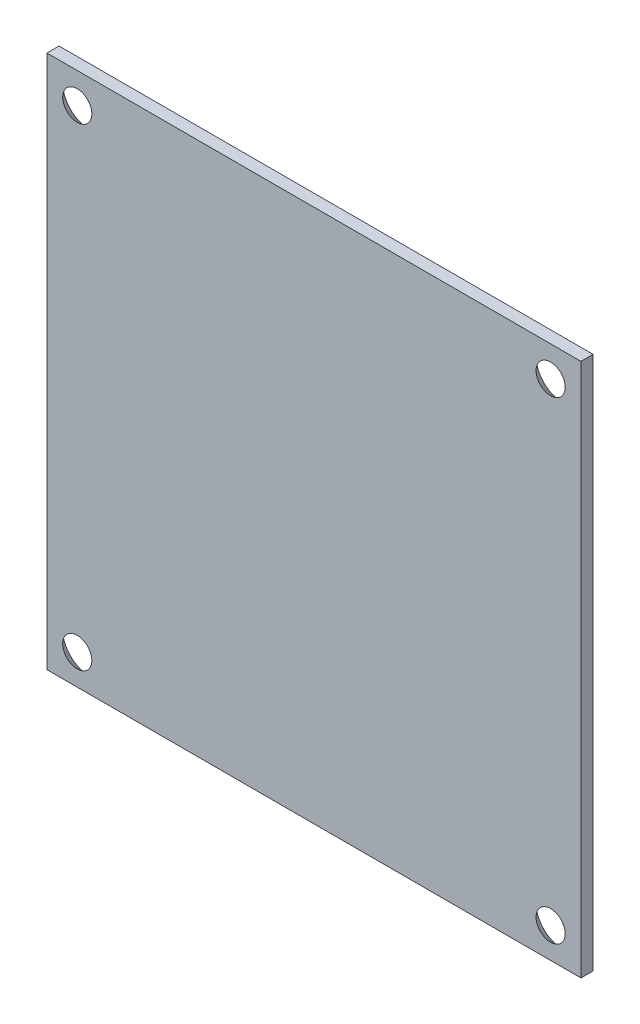
ISO-10303-21;
HEADER;
FILE_DESCRIPTION(('STEP AP214'),'2;1');
FILE_NAME('part.step','',(''),(''),'','','');
FILE_SCHEMA(('AUTOMOTIVE_DESIGN { 1 0 10303 214 1 1 1 1 }'));
ENDSEC;
DATA;
#1=APPLICATION_CONTEXT('core data for automotive mechanical design processes');
#2=APPLICATION_PROTOCOL_DEFINITION('international standard','automotive_design',2000,#1);
#3=PRODUCT_CONTEXT('',#1,'mechanical');
#4=PRODUCT('Part','Part','',(#3));
#5=PRODUCT_RELATED_PRODUCT_CATEGORY('part','',(#4));
#6=PRODUCT_DEFINITION_FORMATION('','',#4);
#7=PRODUCT_DEFINITION_CONTEXT('part definition',#1,'design');
#8=PRODUCT_DEFINITION('design','',#6,#7);
#9=PRODUCT_DEFINITION_SHAPE('','',#8);
#10=(LENGTH_UNIT() NAMED_UNIT(*) SI_UNIT(.MILLI.,.METRE.));
#11=(NAMED_UNIT(*) PLANE_ANGLE_UNIT() SI_UNIT($,.RADIAN.));
#12=(NAMED_UNIT(*) SI_UNIT($,.STERADIAN.) SOLID_ANGLE_UNIT());
#13=UNCERTAINTY_MEASURE_WITH_UNIT(LENGTH_MEASURE(1.E-05),#10,'distance_accuracy_value','');
#14=(GEOMETRIC_REPRESENTATION_CONTEXT(3) GLOBAL_UNCERTAINTY_ASSIGNED_CONTEXT((#13)) GLOBAL_UNIT_ASSIGNED_CONTEXT((#10,
#11,#12)) REPRESENTATION_CONTEXT('',''));
#15=CARTESIAN_POINT('',(0.,0.,0.));
#16=DIRECTION('',(0.,0.,1.));
#17=DIRECTION('',(1.,0.,0.));
#18=AXIS2_PLACEMENT_3D('',#15,#16,#17);
#19=CARTESIAN_POINT('',(22.,22.,1.));
#20=DIRECTION('',(0.,-1.,0.));
#21=DIRECTION('',(0.,0.,-1.));
#22=AXIS2_PLACEMENT_3D('',#19,#20,#21);
#23=PLANE('',#22);
#24=DIRECTION('',(-1.,0.,0.));
#25=VECTOR('',#24,1.);
#26=CARTESIAN_POINT('',(22.,22.,0.));
#27=LINE('',#26,#25);
#28=CARTESIAN_POINT('',(22.,22.,0.));
#29=VERTEX_POINT('',#28);
#30=CARTESIAN_POINT('',(-22.,22.,0.));
#31=VERTEX_POINT('',#30);
#32=EDGE_CURVE('E113',#29,#31,#27,.T.);
#33=ORIENTED_EDGE('',*,*,#32,.T.);
#34=DIRECTION('',(0.,0.,-1.));
#35=VECTOR('',#34,1.);
#36=CARTESIAN_POINT('',(-22.,22.,1.));
#37=LINE('',#36,#35);
#38=CARTESIAN_POINT('',(-22.,22.,1.));
#39=VERTEX_POINT('',#38);
#40=EDGE_CURVE('E11',#39,#31,#37,.T.);
#41=ORIENTED_EDGE('',*,*,#40,.F.);
#42=DIRECTION('',(-1.,0.,0.));
#43=VECTOR('',#42,1.);
#44=CARTESIAN_POINT('',(22.,22.,1.));
#45=LINE('',#44,#43);
#46=CARTESIAN_POINT('',(22.,22.,1.));
#47=VERTEX_POINT('',#46);
#48=EDGE_CURVE('E97',#47,#39,#45,.T.);
#49=ORIENTED_EDGE('',*,*,#48,.F.);
#50=DIRECTION('',(0.,0.,-1.));
#51=VECTOR('',#50,1.);
#52=CARTESIAN_POINT('',(22.,22.,1.));
#53=LINE('',#52,#51);
#54=EDGE_CURVE('E109',#47,#29,#53,.T.);
#55=ORIENTED_EDGE('',*,*,#54,.T.);
#56=EDGE_LOOP('',(#33,#41,#49,#55));
#57=FACE_BOUND('',#56,.T.);
#58=ADVANCED_FACE('F45',(#57),#23,.F.);
#59=CARTESIAN_POINT('',(-22.,-22.,1.));
#60=DIRECTION('',(1.,0.,0.));
#61=DIRECTION('',(0.,0.,-1.));
#62=AXIS2_PLACEMENT_3D('',#59,#60,#61);
#63=PLANE('',#62);
#64=DIRECTION('',(0.,-1.,0.));
#65=VECTOR('',#64,1.);
#66=CARTESIAN_POINT('',(-22.,-22.,0.));
#67=LINE('',#66,#65);
#68=CARTESIAN_POINT('',(-22.,-22.,0.));
#69=VERTEX_POINT('',#68);
#70=EDGE_CURVE('E102',#31,#69,#67,.T.);
#71=ORIENTED_EDGE('',*,*,#70,.T.);
#72=DIRECTION('',(0.,0.,-1.));
#73=VECTOR('',#72,1.);
#74=CARTESIAN_POINT('',(-22.,-22.,1.));
#75=LINE('',#74,#73);
#76=CARTESIAN_POINT('',(-22.,-22.,1.));
#77=VERTEX_POINT('',#76);
#78=EDGE_CURVE('E54',#77,#69,#75,.T.);
#79=ORIENTED_EDGE('',*,*,#78,.F.);
#80=DIRECTION('',(0.,-1.,0.));
#81=VECTOR('',#80,1.);
#82=CARTESIAN_POINT('',(-22.,-22.,1.));
#83=LINE('',#82,#81);
#84=EDGE_CURVE('E92',#39,#77,#83,.T.);
#85=ORIENTED_EDGE('',*,*,#84,.F.);
#86=ORIENTED_EDGE('',*,*,#40,.T.);
#87=EDGE_LOOP('',(#71,#79,#85,#86));
#88=FACE_BOUND('',#87,.T.);
#89=ADVANCED_FACE('F101',(#88),#63,.F.);
#90=CARTESIAN_POINT('',(22.,-22.,1.));
#91=DIRECTION('',(0.,1.,0.));
#92=DIRECTION('',(0.,0.,1.));
#93=AXIS2_PLACEMENT_3D('',#90,#91,#92);
#94=PLANE('',#93);
#95=DIRECTION('',(1.,0.,0.));
#96=VECTOR('',#95,1.);
#97=CARTESIAN_POINT('',(22.,-22.,0.));
#98=LINE('',#97,#96);
#99=CARTESIAN_POINT('',(22.,-22.,0.));
#100=VERTEX_POINT('',#99);
#101=EDGE_CURVE('E79',#69,#100,#98,.T.);
#102=ORIENTED_EDGE('',*,*,#101,.T.);
#103=DIRECTION('',(0.,0.,-1.));
#104=VECTOR('',#103,1.);
#105=CARTESIAN_POINT('',(22.,-22.,1.));
#106=LINE('',#105,#104);
#107=CARTESIAN_POINT('',(22.,-22.,1.));
#108=VERTEX_POINT('',#107);
#109=EDGE_CURVE('E104',#108,#100,#106,.T.);
#110=ORIENTED_EDGE('',*,*,#109,.F.);
#111=DIRECTION('',(1.,0.,0.));
#112=VECTOR('',#111,1.);
#113=CARTESIAN_POINT('',(22.,-22.,1.));
#114=LINE('',#113,#112);
#115=EDGE_CURVE('E95',#77,#108,#114,.T.);
#116=ORIENTED_EDGE('',*,*,#115,.F.);
#117=ORIENTED_EDGE('',*,*,#78,.T.);
#118=EDGE_LOOP('',(#102,#110,#116,#117));
#119=FACE_BOUND('',#118,.T.);
#120=ADVANCED_FACE('F105',(#119),#94,.F.);
#121=CARTESIAN_POINT('',(22.,-22.,1.));
#122=DIRECTION('',(-1.,0.,0.));
#123=DIRECTION('',(0.,0.,1.));
#124=AXIS2_PLACEMENT_3D('',#121,#122,#123);
#125=PLANE('',#124);
#126=DIRECTION('',(0.,1.,0.));
#127=VECTOR('',#126,1.);
#128=CARTESIAN_POINT('',(22.,-22.,0.));
#129=LINE('',#128,#127);
#130=EDGE_CURVE('E85',#100,#29,#129,.T.);
#131=ORIENTED_EDGE('',*,*,#130,.T.);
#132=ORIENTED_EDGE('',*,*,#54,.F.);
#133=DIRECTION('',(0.,1.,0.));
#134=VECTOR('',#133,1.);
#135=CARTESIAN_POINT('',(22.,-22.,1.));
#136=LINE('',#135,#134);
#137=EDGE_CURVE('E62',#108,#47,#136,.T.);
#138=ORIENTED_EDGE('',*,*,#137,.F.);
#139=ORIENTED_EDGE('',*,*,#109,.T.);
#140=EDGE_LOOP('',(#131,#132,#138,#139));
#141=FACE_BOUND('',#140,.T.);
#142=ADVANCED_FACE('F127',(#141),#125,.F.);
#143=CARTESIAN_POINT('',(0.,0.,1.));
#144=DIRECTION('',(0.,0.,-1.));
#145=DIRECTION('',(-1.,0.,0.));
#146=AXIS2_PLACEMENT_3D('',#143,#144,#145);
#147=PLANE('',#146);
#148=CARTESIAN_POINT('',(19.5,-19.5,1.));
#149=DIRECTION('',(0.,0.,-1.));
#150=DIRECTION('',(-1.,0.,0.));
#151=AXIS2_PLACEMENT_3D('',#148,#149,#150);
#152=CIRCLE('',#151,1.2);
#153=CARTESIAN_POINT('',(18.3,-19.5,1.));
#154=VERTEX_POINT('',#153);
#155=EDGE_CURVE('E157',#154,#154,#152,.T.);
#156=ORIENTED_EDGE('',*,*,#155,.T.);
#157=EDGE_LOOP('',(#156));
#158=FACE_BOUND('',#157,.T.);
#159=CARTESIAN_POINT('',(-19.5,-19.5,1.));
#160=DIRECTION('',(0.,0.,-1.));
#161=DIRECTION('',(-1.,0.,0.));
#162=AXIS2_PLACEMENT_3D('',#159,#160,#161);
#163=CIRCLE('',#162,1.2);
#164=CARTESIAN_POINT('',(-20.7,-19.5,1.));
#165=VERTEX_POINT('',#164);
#166=EDGE_CURVE('E149',#165,#165,#163,.T.);
#167=ORIENTED_EDGE('',*,*,#166,.T.);
#168=EDGE_LOOP('',(#167));
#169=FACE_BOUND('',#168,.T.);
#170=CARTESIAN_POINT('',(19.5,19.5,1.));
#171=DIRECTION('',(0.,0.,-1.));
#172=DIRECTION('',(-1.,0.,0.));
#173=AXIS2_PLACEMENT_3D('',#170,#171,#172);
#174=CIRCLE('',#173,1.2);
#175=CARTESIAN_POINT('',(18.3,19.5,1.));
#176=VERTEX_POINT('',#175);
#177=EDGE_CURVE('E141',#176,#176,#174,.T.);
#178=ORIENTED_EDGE('',*,*,#177,.T.);
#179=EDGE_LOOP('',(#178));
#180=FACE_BOUND('',#179,.T.);
#181=CARTESIAN_POINT('',(-19.5,19.5,1.));
#182=DIRECTION('',(0.,0.,-1.));
#183=DIRECTION('',(-1.,0.,0.));
#184=AXIS2_PLACEMENT_3D('',#181,#182,#183);
#185=CIRCLE('',#184,1.2);
#186=CARTESIAN_POINT('',(-20.7,19.5,1.));
#187=VERTEX_POINT('',#186);
#188=EDGE_CURVE('E117',#187,#187,#185,.T.);
#189=ORIENTED_EDGE('',*,*,#188,.T.);
#190=EDGE_LOOP('',(#189));
#191=FACE_BOUND('',#190,.T.);
#192=ORIENTED_EDGE('',*,*,#48,.T.);
#193=ORIENTED_EDGE('',*,*,#84,.T.);
#194=ORIENTED_EDGE('',*,*,#115,.T.);
#195=ORIENTED_EDGE('',*,*,#137,.T.);
#196=EDGE_LOOP('',(#192,#193,#194,#195));
#197=FACE_BOUND('',#196,.T.);
#198=ADVANCED_FACE('F93',(#158,#169,#180,#191,#197),#147,.F.);
#199=CARTESIAN_POINT('',(0.,0.,0.));
#200=DIRECTION('',(0.,0.,-1.));
#201=DIRECTION('',(-1.,0.,0.));
#202=AXIS2_PLACEMENT_3D('',#199,#200,#201);
#203=PLANE('',#202);
#204=CARTESIAN_POINT('',(19.5,-19.5,0.));
#205=DIRECTION('',(0.,0.,-1.));
#206=DIRECTION('',(-1.,0.,0.));
#207=AXIS2_PLACEMENT_3D('',#204,#205,#206);
#208=CIRCLE('',#207,2.2);
#209=CARTESIAN_POINT('',(17.3,-19.5,0.));
#210=VERTEX_POINT('',#209);
#211=EDGE_CURVE('E161',#210,#210,#208,.T.);
#212=ORIENTED_EDGE('',*,*,#211,.F.);
#213=EDGE_LOOP('',(#212));
#214=FACE_BOUND('',#213,.T.);
#215=CARTESIAN_POINT('',(-19.5,-19.5,0.));
#216=DIRECTION('',(0.,0.,-1.));
#217=DIRECTION('',(-1.,0.,0.));
#218=AXIS2_PLACEMENT_3D('',#215,#216,#217);
#219=CIRCLE('',#218,2.2);
#220=CARTESIAN_POINT('',(-21.7,-19.5,0.));
#221=VERTEX_POINT('',#220);
#222=EDGE_CURVE('E153',#221,#221,#219,.T.);
#223=ORIENTED_EDGE('',*,*,#222,.F.);
#224=EDGE_LOOP('',(#223));
#225=FACE_BOUND('',#224,.T.);
#226=CARTESIAN_POINT('',(19.5,19.5,0.));
#227=DIRECTION('',(0.,0.,-1.));
#228=DIRECTION('',(-1.,0.,0.));
#229=AXIS2_PLACEMENT_3D('',#226,#227,#228);
#230=CIRCLE('',#229,2.2);
#231=CARTESIAN_POINT('',(17.3,19.5,0.));
#232=VERTEX_POINT('',#231);
#233=EDGE_CURVE('E145',#232,#232,#230,.T.);
#234=ORIENTED_EDGE('',*,*,#233,.F.);
#235=EDGE_LOOP('',(#234));
#236=FACE_BOUND('',#235,.T.);
#237=CARTESIAN_POINT('',(-19.5,19.5,0.));
#238=DIRECTION('',(0.,0.,-1.));
#239=DIRECTION('',(-1.,0.,0.));
#240=AXIS2_PLACEMENT_3D('',#237,#238,#239);
#241=CIRCLE('',#240,2.2);
#242=CARTESIAN_POINT('',(-21.7,19.5,0.));
#243=VERTEX_POINT('',#242);
#244=EDGE_CURVE('E137',#243,#243,#241,.T.);
#245=ORIENTED_EDGE('',*,*,#244,.F.);
#246=EDGE_LOOP('',(#245));
#247=FACE_BOUND('',#246,.T.);
#248=ORIENTED_EDGE('',*,*,#32,.F.);
#249=ORIENTED_EDGE('',*,*,#130,.F.);
#250=ORIENTED_EDGE('',*,*,#101,.F.);
#251=ORIENTED_EDGE('',*,*,#70,.F.);
#252=EDGE_LOOP('',(#248,#249,#250,#251));
#253=FACE_BOUND('',#252,.T.);
#254=ADVANCED_FACE('F130',(#214,#225,#236,#247,#253),#203,.T.);
#255=CARTESIAN_POINT('',(-19.5,19.5,0.));
#256=DIRECTION('',(0.,0.,-1.));
#257=DIRECTION('',(-1.,0.,0.));
#258=AXIS2_PLACEMENT_3D('',#255,#256,#257);
#259=CONICAL_SURFACE('',#258,2.2,0.785398163397447);
#260=ORIENTED_EDGE('',*,*,#188,.F.);
#261=EDGE_LOOP('',(#260));
#262=FACE_BOUND('',#261,.T.);
#263=ORIENTED_EDGE('',*,*,#244,.T.);
#264=EDGE_LOOP('',(#263));
#265=FACE_BOUND('',#264,.T.);
#266=ADVANCED_FACE('F170',(#262,#265),#259,.F.);
#267=CARTESIAN_POINT('',(19.5,19.5,0.));
#268=DIRECTION('',(0.,0.,-1.));
#269=DIRECTION('',(-1.,0.,0.));
#270=AXIS2_PLACEMENT_3D('',#267,#268,#269);
#271=CONICAL_SURFACE('',#270,2.2,0.785398163397447);
#272=ORIENTED_EDGE('',*,*,#177,.F.);
#273=EDGE_LOOP('',(#272));
#274=FACE_BOUND('',#273,.T.);
#275=ORIENTED_EDGE('',*,*,#233,.T.);
#276=EDGE_LOOP('',(#275));
#277=FACE_BOUND('',#276,.T.);
#278=ADVANCED_FACE('F179',(#274,#277),#271,.F.);
#279=CARTESIAN_POINT('',(-19.5,-19.5,0.));
#280=DIRECTION('',(0.,0.,-1.));
#281=DIRECTION('',(-1.,0.,0.));
#282=AXIS2_PLACEMENT_3D('',#279,#280,#281);
#283=CONICAL_SURFACE('',#282,2.2,0.785398163397447);
#284=ORIENTED_EDGE('',*,*,#166,.F.);
#285=EDGE_LOOP('',(#284));
#286=FACE_BOUND('',#285,.T.);
#287=ORIENTED_EDGE('',*,*,#222,.T.);
#288=EDGE_LOOP('',(#287));
#289=FACE_BOUND('',#288,.T.);
#290=ADVANCED_FACE('F186',(#286,#289),#283,.F.);
#291=CARTESIAN_POINT('',(19.5,-19.5,0.));
#292=DIRECTION('',(0.,0.,-1.));
#293=DIRECTION('',(-1.,0.,0.));
#294=AXIS2_PLACEMENT_3D('',#291,#292,#293);
#295=CONICAL_SURFACE('',#294,2.2,0.785398163397447);
#296=ORIENTED_EDGE('',*,*,#155,.F.);
#297=EDGE_LOOP('',(#296));
#298=FACE_BOUND('',#297,.T.);
#299=ORIENTED_EDGE('',*,*,#211,.T.);
#300=EDGE_LOOP('',(#299));
#301=FACE_BOUND('',#300,.T.);
#302=ADVANCED_FACE('F166',(#298,#301),#295,.F.);
#303=CLOSED_SHELL('',(#58,#89,#120,#142,#198,#254,#266,#278,#290,#302));
#304=MANIFOLD_SOLID_BREP('B2',#303);
#305=ADVANCED_BREP_SHAPE_REPRESENTATION('',(#18,#304),#14);
#306=SHAPE_DEFINITION_REPRESENTATION(#9,#305);
ENDSEC;
END-ISO-10303-21;
